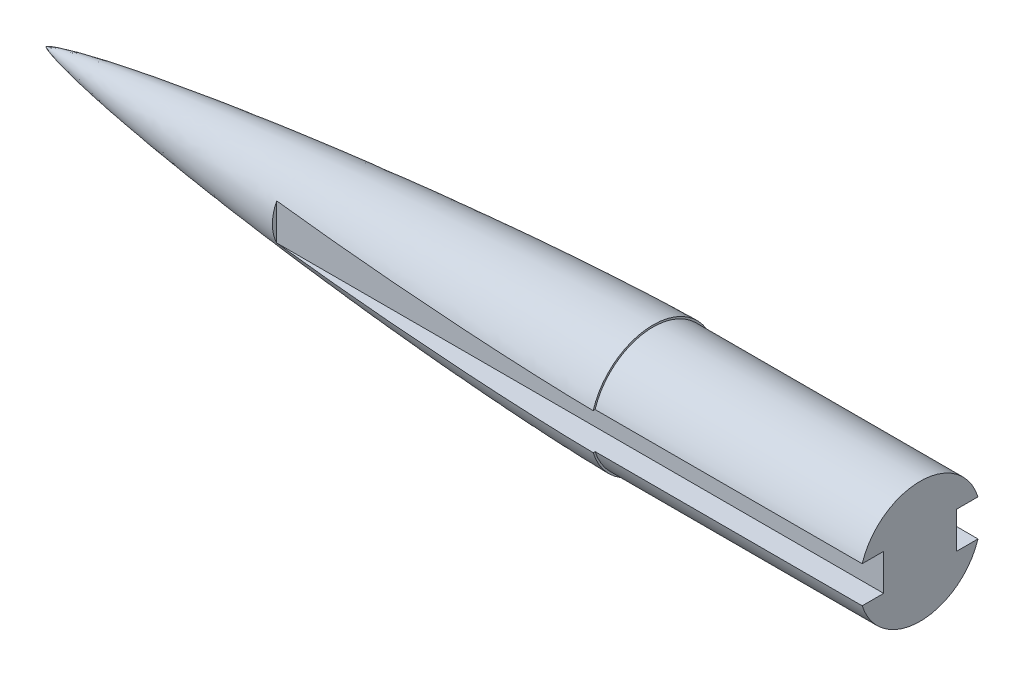
ISO-10303-21;
HEADER;
FILE_DESCRIPTION(('STEP AP214'),'2;1');
FILE_NAME('part.step','',(''),(''),'','','');
FILE_SCHEMA(('AUTOMOTIVE_DESIGN { 1 0 10303 214 1 1 1 1 }'));
ENDSEC;
DATA;
#1=APPLICATION_CONTEXT('core data for automotive mechanical design processes');
#2=APPLICATION_PROTOCOL_DEFINITION('international standard','automotive_design',2000,#1);
#3=PRODUCT_CONTEXT('',#1,'mechanical');
#4=PRODUCT('Part','Part','',(#3));
#5=PRODUCT_RELATED_PRODUCT_CATEGORY('part','',(#4));
#6=PRODUCT_DEFINITION_FORMATION('','',#4);
#7=PRODUCT_DEFINITION_CONTEXT('part definition',#1,'design');
#8=PRODUCT_DEFINITION('design','',#6,#7);
#9=PRODUCT_DEFINITION_SHAPE('','',#8);
#10=(LENGTH_UNIT() NAMED_UNIT(*) SI_UNIT(.MILLI.,.METRE.));
#11=(NAMED_UNIT(*) PLANE_ANGLE_UNIT() SI_UNIT($,.RADIAN.));
#12=(NAMED_UNIT(*) SI_UNIT($,.STERADIAN.) SOLID_ANGLE_UNIT());
#13=UNCERTAINTY_MEASURE_WITH_UNIT(LENGTH_MEASURE(1.E-05),#10,'distance_accuracy_value','');
#14=(GEOMETRIC_REPRESENTATION_CONTEXT(3) GLOBAL_UNCERTAINTY_ASSIGNED_CONTEXT((#13)) GLOBAL_UNIT_ASSIGNED_CONTEXT((#10,
#11,#12)) REPRESENTATION_CONTEXT('',''));
#15=CARTESIAN_POINT('',(0.,0.,0.));
#16=DIRECTION('',(0.,0.,1.));
#17=DIRECTION('',(1.,0.,0.));
#18=AXIS2_PLACEMENT_3D('',#15,#16,#17);
#19=CARTESIAN_POINT('',(635.,65.405,0.));
#20=CARTESIAN_POINT('',(632.980968041376,65.3999049079982,0.));
#21=CARTESIAN_POINT('',(628.943051518666,65.3607987649682,0.));
#22=CARTESIAN_POINT('',(620.867800743739,65.238425835158,0.));
#23=CARTESIAN_POINT('',(607.876612197197,64.9420444267635,0.));
#24=CARTESIAN_POINT('',(591.989866173885,64.4665825864284,0.));
#25=CARTESIAN_POINT('',(568.294487812533,63.5924578117391,0.));
#26=CARTESIAN_POINT('',(538.814064527861,62.2664605978091,0.));
#27=CARTESIAN_POINT('',(504.434100625351,60.4361863708921,0.));
#28=CARTESIAN_POINT('',(465.161890456531,58.0127528854532,0.));
#29=CARTESIAN_POINT('',(425.909385737502,55.2895252497301,0.));
#30=CARTESIAN_POINT('',(386.677550901074,52.2836135264071,0.));
#31=CARTESIAN_POINT('',(347.46776242828,49.0025673324941,0.));
#32=CARTESIAN_POINT('',(308.282068325667,45.4454012222465,0.));
#33=CARTESIAN_POINT('',(269.123174714222,41.6037605555624,0.));
#34=CARTESIAN_POINT('',(229.995170684784,37.4592339547084,0.));
#35=CARTESIAN_POINT('',(190.90356887878,32.9826992551564,0.));
#36=CARTESIAN_POINT('',(151.857530337521,28.1241973222402,0.));
#37=CARTESIAN_POINT('',(112.870807325211,22.8061369351955,0.));
#38=CARTESIAN_POINT('',(77.9573287846358,17.4873019784259,0.));
#39=CARTESIAN_POINT('',(49.1787935546804,12.5135793040533,0.));
#40=CARTESIAN_POINT('',(28.2617417770008,8.30499279351691,0.));
#41=CARTESIAN_POINT('',(16.0220282949449,5.44625020056791,0.));
#42=CARTESIAN_POINT('',(8.93318062814798,3.51548578780447,0.));
#43=CARTESIAN_POINT('',(5.16339541485639,2.32840347516785,0.));
#44=CARTESIAN_POINT('',(3.11582679923173,1.59218900684347,0.));
#45=CARTESIAN_POINT('',(1.97027691704133,1.1275016191836,0.));
#46=CARTESIAN_POINT('',(1.33181141167439,0.839140676757945,0.));
#47=CARTESIAN_POINT('',(0.95671602904962,0.653660621097922,0.));
#48=CARTESIAN_POINT('',(0.715531562152649,0.525146597932932,0.));
#49=CARTESIAN_POINT('',(0.550210431495335,0.431764809009291,0.));
#50=CARTESIAN_POINT('',(0.406270251751136,0.344359984283262,0.));
#51=CARTESIAN_POINT('',(0.283649615611126,0.263361482709997,0.));
#52=CARTESIAN_POINT('',(0.181602895816827,0.18888943286587,0.));
#53=CARTESIAN_POINT('',(0.109817079168359,0.130424863371353,0.));
#54=CARTESIAN_POINT('',(0.0569836765196351,0.0804262546774983,0.));
#55=CARTESIAN_POINT('',(0.0222716682134025,0.0403845586316774,0.));
#56=CARTESIAN_POINT('',(0.00752296936524731,0.0183675987536798,0.));
#57=CARTESIAN_POINT('',(0.00219211488346488,0.0062902080222314,0.));
#58=CARTESIAN_POINT('',(0.,0.,0.));
#59=B_SPLINE_CURVE_WITH_KNOTS('',4,(#19,#20,#21,#22,#23,#24,#25,#26,#27,#28,#29,#30,#31,#32,#33,
#34,#35,#36,#37,#38,#39,#40,#41,#42,#43,#44,#45,#46,#47,#48,#49,#50,#51,#52,#53,#54,#55,#56,#57,
#58),.UNSPECIFIED.,.F.,.F.,(5,1,1,1,1,1,1,1,1,1,1,1,1,1,1,1,1,1,1,1,1,1,1,1,1,1,1,1,1,1,1,1,1,1,
1,1,5),(0.,0.0126278600836156,0.0252557201672313,0.0505114403344626,0.0812725997628029,
0.112033759191143,0.173556078208551,0.235078396298971,0.296600715210933,0.358123034494872,
0.419645352372099,0.481167670690979,0.542689989321029,0.604212308113024,0.665734626856386,
0.727256945203041,0.788779262537685,0.850301578000527,0.911823895791277,0.948128969524394,
0.971421118017023,0.983729988096585,0.990421707276453,0.994070390445943,0.996134035175531,
0.997335608030765,0.998151497389768,0.998451073952135,0.998750650514502,0.999044750264593,
0.999338850014684,0.999504137511013,0.999669425007342,0.999834712503671,0.999917356251836,
0.999958678125918,1.),.UNSPECIFIED.);
#60=CARTESIAN_POINT('',(0.,0.,0.));
#61=DIRECTION('',(-1.,0.,0.));
#62=AXIS1_PLACEMENT('',#60,#61);
#63=SURFACE_OF_REVOLUTION('',#59,#62);
#64=CARTESIAN_POINT('',(0.,0.,0.));
#65=VERTEX_POINT('',#64);
#66=VERTEX_LOOP('',#65);
#67=FACE_BOUND('',#66,.T.);
#68=CARTESIAN_POINT('',(635.,0.,0.));
#69=DIRECTION('',(-1.,0.,0.));
#70=DIRECTION('',(0.,0.,1.));
#71=AXIS2_PLACEMENT_3D('',#68,#69,#70);
#72=CIRCLE('',#71,65.405);
#73=CARTESIAN_POINT('',(635.,-19.05,-62.5692538312548));
#74=VERTEX_POINT('',#73);
#75=CARTESIAN_POINT('',(635.,-19.05,62.5692538312548));
#76=VERTEX_POINT('',#75);
#77=EDGE_CURVE('E339',#74,#76,#72,.T.);
#78=ORIENTED_EDGE('',*,*,#77,.T.);
#79=CARTESIAN_POINT('',(635.,-19.05,62.5692538312548));
#80=CARTESIAN_POINT('',(634.557083227714,-19.05,62.5680767827386));
#81=CARTESIAN_POINT('',(634.114169517042,-19.05,62.5660986690757));
#82=CARTESIAN_POINT('',(633.228351345894,-19.05,62.5608098709747));
#83=CARTESIAN_POINT('',(632.785446885394,-19.05,62.5574991908365));
#84=CARTESIAN_POINT('',(631.89965061563,-19.05,62.5498148354016));
#85=CARTESIAN_POINT('',(631.4567588063,-19.05,62.5454411676234));
#86=CARTESIAN_POINT('',(630.570984215481,-19.05,62.535832944144));
#87=CARTESIAN_POINT('',(630.128101434002,-19.05,62.5305983876272));
#88=CARTESIAN_POINT('',(628.799478545877,-19.05,62.5138639372397));
#89=CARTESIAN_POINT('',(627.913751433359,-19.05,62.5013331442501));
#90=CARTESIAN_POINT('',(626.142327837132,-19.05,62.4741748127137));
#91=CARTESIAN_POINT('',(625.256631353498,-19.05,62.4595472693344));
#92=CARTESIAN_POINT('',(623.485390490442,-19.05,62.428380840316));
#93=CARTESIAN_POINT('',(622.599846106515,-19.05,62.411842210447));
#94=CARTESIAN_POINT('',(620.828792008821,-19.05,62.3770503313055));
#95=CARTESIAN_POINT('',(619.943282295023,-19.05,62.3587970836627));
#96=CARTESIAN_POINT('',(618.172292993631,-19.05,62.3207165380793));
#97=CARTESIAN_POINT('',(617.286813406182,-19.05,62.3008892334446));
#98=CARTESIAN_POINT('',(615.515887967395,-19.05,62.2597749944506));
#99=CARTESIAN_POINT('',(614.630442116068,-19.05,62.2384880596449));
#100=CARTESIAN_POINT('',(611.974244993545,-19.05,62.1725975135477));
#101=CARTESIAN_POINT('',(610.203543874418,-19.05,62.1259621974595));
#102=CARTESIAN_POINT('',(606.662276890252,-19.05,62.0279383805772));
#103=CARTESIAN_POINT('',(604.891711025004,-19.05,61.97654988728));
#104=CARTESIAN_POINT('',(601.350746669525,-19.05,61.869453214738));
#105=CARTESIAN_POINT('',(599.580348176592,-19.05,61.8137451247721));
#106=CARTESIAN_POINT('',(596.039682239263,-19.05,61.6982997093811));
#107=CARTESIAN_POINT('',(594.269414794927,-19.05,61.6385623821518));
#108=CARTESIAN_POINT('',(588.95883696801,-19.05,61.4537211090585));
#109=CARTESIAN_POINT('',(585.418721528203,-19.05,61.3229869683053));
#110=CARTESIAN_POINT('',(578.339012892391,-19.05,61.0481671003937));
#111=CARTESIAN_POINT('',(574.799419696279,-19.05,60.9040813759957));
#112=CARTESIAN_POINT('',(567.722059853378,-19.05,60.6038120220145));
#113=CARTESIAN_POINT('',(564.184293015472,-19.05,60.4476328904689));
#114=CARTESIAN_POINT('',(557.109224970274,-19.05,60.1239884992728));
#115=CARTESIAN_POINT('',(553.571923770502,-19.05,59.956523075538));
#116=CARTESIAN_POINT('',(546.497790316003,-19.05,59.6109883948176));
#117=CARTESIAN_POINT('',(542.960958068526,-19.05,59.4329189895628));
#118=CARTESIAN_POINT('',(535.887771335781,-19.05,59.0667592304303));
#119=CARTESIAN_POINT('',(532.351416856595,-19.05,58.8786687591731));
#120=CARTESIAN_POINT('',(525.279200186501,-19.05,58.4929330268145));
#121=CARTESIAN_POINT('',(521.743337999863,-19.05,58.2952876874633));
#122=CARTESIAN_POINT('',(514.672127138324,-19.05,57.8908005712422));
#123=CARTESIAN_POINT('',(511.13677846542,-19.05,57.6839587595328));
#124=CARTESIAN_POINT('',(501.257875484606,-19.05,57.0935266125025));
#125=CARTESIAN_POINT('',(494.914908059981,-19.05,56.7000791009063));
#126=CARTESIAN_POINT('',(482.230757328668,-19.05,55.8859928959795));
#127=CARTESIAN_POINT('',(475.889574012391,-19.05,55.4653543516972));
#128=CARTESIAN_POINT('',(463.209023514057,-19.05,54.5978206233442));
#129=CARTESIAN_POINT('',(456.869656326529,-19.05,54.1509255192251));
#130=CARTESIAN_POINT('',(444.192797036056,-19.05,53.2315009162489));
#131=CARTESIAN_POINT('',(437.855304928706,-19.05,52.7589714780941));
#132=CARTESIAN_POINT('',(425.182276303033,-19.05,51.7885903788954));
#133=CARTESIAN_POINT('',(418.8467397797,-19.05,51.29073878326));
#134=CARTESIAN_POINT('',(406.177720562544,-19.05,50.2697854229068));
#135=CARTESIAN_POINT('',(399.844237862635,-19.05,49.7466837337029));
#136=CARTESIAN_POINT('',(387.175311204038,-19.05,48.6746948739136));
#137=CARTESIAN_POINT('',(380.839868643589,-19.05,48.1257911751438));
#138=CARTESIAN_POINT('',(368.171282857661,-19.05,47.0020631167245));
#139=CARTESIAN_POINT('',(361.838139631864,-19.05,46.4272387606654));
#140=CARTESIAN_POINT('',(349.174326985137,-19.05,45.2509275709008));
#141=CARTESIAN_POINT('',(342.843657564713,-19.05,44.6494407317415));
#142=CARTESIAN_POINT('',(330.184998888784,-19.05,43.4187476888266));
#143=CARTESIAN_POINT('',(323.857009639081,-19.05,42.789541425367));
#144=CARTESIAN_POINT('',(311.203948862567,-19.05,41.5019762697636));
#145=CARTESIAN_POINT('',(304.87887735573,-19.05,40.8436171809514));
#146=CARTESIAN_POINT('',(295.393711650985,-19.05,39.8327429327034));
#147=CARTESIAN_POINT('',(292.232371358853,-19.05,39.4918927566739));
#148=CARTESIAN_POINT('',(285.910572365251,-19.05,38.8020972218567));
#149=CARTESIAN_POINT('',(282.750113664291,-19.05,38.4531518584028));
#150=CARTESIAN_POINT('',(279.590122994068,-19.05,38.1000000000001));
#151=B_SPLINE_CURVE_WITH_KNOTS('',3,(#79,#80,#81,#82,#83,#84,#85,#86,#87,#88,#89,#90,#91,#92,
#93,#94,#95,#96,#97,#98,#99,#100,#101,#102,#103,#104,#105,#106,#107,#108,#109,#110,#111,#112,
#113,#114,#115,#116,#117,#118,#119,#120,#121,#122,#123,#124,#125,#126,#127,#128,#129,#130,#131,
#132,#133,#134,#135,#136,#137,#138,#139,#140,#141,#142,#143,#144,#145,#146,#147,#148,#149,#150),
.UNSPECIFIED.,.F.,.F.,(4,2,2,2,2,2,2,2,2,2,2,2,2,2,2,2,2,2,2,2,2,2,2,2,2,2,2,2,2,2,2,2,2,2,2,4),
(0.,1.32875293976185,2.65750159196408,3.98624084643328,5.31498135989972,7.9724249987702,
10.6298747626342,13.2869692779771,15.9440612676412,18.6011645575266,21.2582686597338,
26.5722059631715,31.886134885276,37.1999540063862,42.5137755066771,53.1413297766517,
63.7688818494151,74.3924999102607,85.0162724545974,95.640193579748,106.264239173051,
116.888371786844,127.512544651846,146.577952725099,165.643256299794,184.708501823413,
203.773702202304,222.83885333723,241.90394745863,260.981425258237,280.0589004153,
299.136379474817,318.213899626885,337.291548497805,346.830525772525,356.369508545715),.UNSPECIFIED.);
#152=CARTESIAN_POINT('',(279.590122994068,-19.05,38.1));
#153=VERTEX_POINT('',#152);
#154=EDGE_CURVE('E268',#76,#153,#151,.T.);
#155=ORIENTED_EDGE('',*,*,#154,.T.);
#156=CARTESIAN_POINT('',(279.4,-19.0074579829743,38.1));
#157=CARTESIAN_POINT('',(279.463374331356,-19.0216386553162,38.1));
#158=CARTESIAN_POINT('',(279.526748662712,-19.0358193276581,38.1));
#159=CARTESIAN_POINT('',(279.590122994068,-19.05,38.1));
#160=B_SPLINE_CURVE_WITH_KNOTS('',3,(#156,#157,#158,#159),.UNSPECIFIED.,.F.,.F.,(4,4),(0.,
0.19482447506949),.UNSPECIFIED.);
#161=CARTESIAN_POINT('',(279.4,-19.0074579829743,38.1));
#162=VERTEX_POINT('',#161);
#163=EDGE_CURVE('E253',#162,#153,#160,.T.);
#164=ORIENTED_EDGE('',*,*,#163,.F.);
#165=CARTESIAN_POINT('',(279.4,0.,0.));
#166=DIRECTION('',(-1.,0.,0.));
#167=DIRECTION('',(0.,0.,1.));
#168=AXIS2_PLACEMENT_3D('',#165,#166,#167);
#169=CIRCLE('',#168,42.5780866053718);
#170=CARTESIAN_POINT('',(279.4,19.0074579829743,38.1));
#171=VERTEX_POINT('',#170);
#172=EDGE_CURVE('E11',#171,#162,#169,.F.);
#173=ORIENTED_EDGE('',*,*,#172,.F.);
#174=CARTESIAN_POINT('',(279.590122994068,19.05,38.1));
#175=CARTESIAN_POINT('',(279.526748662712,19.0358193276581,38.1));
#176=CARTESIAN_POINT('',(279.463374331356,19.0216386553162,38.1));
#177=CARTESIAN_POINT('',(279.4,19.0074579829743,38.1));
#178=B_SPLINE_CURVE_WITH_KNOTS('',3,(#174,#175,#176,#177),.UNSPECIFIED.,.F.,.F.,(4,4),(0.,
0.194824475069432),.UNSPECIFIED.);
#179=CARTESIAN_POINT('',(279.590122994068,19.05,38.1));
#180=VERTEX_POINT('',#179);
#181=EDGE_CURVE('E245',#180,#171,#178,.T.);
#182=ORIENTED_EDGE('',*,*,#181,.F.);
#183=CARTESIAN_POINT('',(635.,19.05,62.5692538312549));
#184=CARTESIAN_POINT('',(634.557083227714,19.05,62.5680767827386));
#185=CARTESIAN_POINT('',(634.114169517042,19.05,62.5660986690757));
#186=CARTESIAN_POINT('',(633.228351345894,19.05,62.5608098709747));
#187=CARTESIAN_POINT('',(632.785446885394,19.05,62.5574991908365));
#188=CARTESIAN_POINT('',(631.89965061563,19.05,62.5498148354016));
#189=CARTESIAN_POINT('',(631.4567588063,19.05,62.5454411676234));
#190=CARTESIAN_POINT('',(630.570984215481,19.05,62.535832944144));
#191=CARTESIAN_POINT('',(630.128101434002,19.05,62.5305983876272));
#192=CARTESIAN_POINT('',(628.799478545877,19.05,62.5138639372397));
#193=CARTESIAN_POINT('',(627.913751433359,19.05,62.5013331442501));
#194=CARTESIAN_POINT('',(626.142327837132,19.05,62.4741748127137));
#195=CARTESIAN_POINT('',(625.256631353498,19.05,62.4595472693344));
#196=CARTESIAN_POINT('',(623.485390490442,19.05,62.428380840316));
#197=CARTESIAN_POINT('',(622.599846106515,19.05,62.411842210447));
#198=CARTESIAN_POINT('',(620.828792008821,19.05,62.3770503313055));
#199=CARTESIAN_POINT('',(619.943282295023,19.05,62.3587970836627));
#200=CARTESIAN_POINT('',(618.172292993631,19.05,62.3207165380793));
#201=CARTESIAN_POINT('',(617.286813406182,19.05,62.3008892334447));
#202=CARTESIAN_POINT('',(615.515887967395,19.05,62.2597749944506));
#203=CARTESIAN_POINT('',(614.630442116068,19.05,62.238488059645));
#204=CARTESIAN_POINT('',(611.974244993545,19.05,62.1725975135477));
#205=CARTESIAN_POINT('',(610.203543874418,19.05,62.1259621974595));
#206=CARTESIAN_POINT('',(606.662276890252,19.05,62.0279383805772));
#207=CARTESIAN_POINT('',(604.891711025004,19.05,61.97654988728));
#208=CARTESIAN_POINT('',(601.350746669525,19.05,61.869453214738));
#209=CARTESIAN_POINT('',(599.580348176592,19.05,61.8137451247722));
#210=CARTESIAN_POINT('',(596.039682239263,19.05,61.6982997093811));
#211=CARTESIAN_POINT('',(594.269414794926,19.05,61.6385623821518));
#212=CARTESIAN_POINT('',(588.95883696801,19.05,61.4537211090585));
#213=CARTESIAN_POINT('',(585.418721528203,19.05,61.3229869683053));
#214=CARTESIAN_POINT('',(578.339012892391,19.05,61.0481671003937));
#215=CARTESIAN_POINT('',(574.799419696279,19.05,60.9040813759957));
#216=CARTESIAN_POINT('',(567.722059853378,19.05,60.6038120220145));
#217=CARTESIAN_POINT('',(564.184293015471,19.05,60.4476328904689));
#218=CARTESIAN_POINT('',(557.109224970274,19.05,60.1239884992728));
#219=CARTESIAN_POINT('',(553.571923770502,19.05,59.956523075538));
#220=CARTESIAN_POINT('',(546.497790316003,19.05,59.6109883948176));
#221=CARTESIAN_POINT('',(542.960958068526,19.05,59.4329189895628));
#222=CARTESIAN_POINT('',(535.887771335781,19.05,59.0667592304303));
#223=CARTESIAN_POINT('',(532.351416856594,19.05,58.8786687591731));
#224=CARTESIAN_POINT('',(525.279200186501,19.05,58.4929330268145));
#225=CARTESIAN_POINT('',(521.743337999863,19.05,58.2952876874633));
#226=CARTESIAN_POINT('',(514.672127138324,19.05,57.8908005712422));
#227=CARTESIAN_POINT('',(511.136778465419,19.05,57.6839587595328));
#228=CARTESIAN_POINT('',(501.257875484605,19.05,57.0935266125026));
#229=CARTESIAN_POINT('',(494.914908059981,19.05,56.7000791009063));
#230=CARTESIAN_POINT('',(482.230757328667,19.05,55.8859928959795));
#231=CARTESIAN_POINT('',(475.88957401239,19.05,55.4653543516972));
#232=CARTESIAN_POINT('',(463.209023514057,19.05,54.5978206233442));
#233=CARTESIAN_POINT('',(456.869656326529,19.05,54.1509255192251));
#234=CARTESIAN_POINT('',(444.192797036056,19.05,53.2315009162489));
#235=CARTESIAN_POINT('',(437.855304928706,19.05,52.7589714780941));
#236=CARTESIAN_POINT('',(425.182276303033,19.05,51.7885903788954));
#237=CARTESIAN_POINT('',(418.8467397797,19.05,51.29073878326));
#238=CARTESIAN_POINT('',(406.177720562544,19.05,50.2697854229068));
#239=CARTESIAN_POINT('',(399.844237862635,19.05,49.7466837337029));
#240=CARTESIAN_POINT('',(387.175311204038,19.05,48.6746948739136));
#241=CARTESIAN_POINT('',(380.839868643589,19.05,48.1257911751439));
#242=CARTESIAN_POINT('',(368.171282857661,19.05,47.0020631167245));
#243=CARTESIAN_POINT('',(361.838139631864,19.05,46.4272387606654));
#244=CARTESIAN_POINT('',(349.174326985137,19.05,45.2509275709008));
#245=CARTESIAN_POINT('',(342.843657564713,19.05,44.6494407317415));
#246=CARTESIAN_POINT('',(330.184998888784,19.05,43.4187476888266));
#247=CARTESIAN_POINT('',(323.857009639081,19.05,42.789541425367));
#248=CARTESIAN_POINT('',(311.203948862567,19.05,41.5019762697636));
#249=CARTESIAN_POINT('',(304.87887735573,19.05,40.8436171809513));
#250=CARTESIAN_POINT('',(295.393711650985,19.05,39.8327429327034));
#251=CARTESIAN_POINT('',(292.232371358853,19.05,39.4918927566739));
#252=CARTESIAN_POINT('',(285.910572365251,19.05,38.8020972218567));
#253=CARTESIAN_POINT('',(282.750113664291,19.05,38.4531518584028));
#254=CARTESIAN_POINT('',(279.590122994068,19.05,38.1));
#255=B_SPLINE_CURVE_WITH_KNOTS('',3,(#183,#184,#185,#186,#187,#188,#189,#190,#191,#192,#193,
#194,#195,#196,#197,#198,#199,#200,#201,#202,#203,#204,#205,#206,#207,#208,#209,#210,#211,#212,
#213,#214,#215,#216,#217,#218,#219,#220,#221,#222,#223,#224,#225,#226,#227,#228,#229,#230,#231,
#232,#233,#234,#235,#236,#237,#238,#239,#240,#241,#242,#243,#244,#245,#246,#247,#248,#249,#250,
#251,#252,#253,#254),.UNSPECIFIED.,.F.,.F.,(4,2,2,2,2,2,2,2,2,2,2,2,2,2,2,2,2,2,2,2,2,2,2,2,2,2,
2,2,2,2,2,2,2,2,2,4),(0.,1.32875293976185,2.65750159196408,3.98624084643328,5.31498135989972,
7.9724249987702,10.6298747626342,13.2869692779773,15.9440612676413,18.6011645575266,
21.2582686597339,26.5722059631715,31.886134885276,37.1999540063863,42.5137755066772,
53.1413297766518,63.7688818494152,74.3924999102609,85.0162724545975,95.640193579748,
106.264239173051,116.888371786844,127.512544651846,146.577952725099,165.643256299795,
184.708501823413,203.773702202304,222.83885333723,241.90394745863,260.981425258237,
280.0589004153,299.136379474817,318.213899626885,337.291548497805,346.830525772525,
356.369508545715),.UNSPECIFIED.);
#256=CARTESIAN_POINT('',(635.,19.05,62.5692538312549));
#257=VERTEX_POINT('',#256);
#258=EDGE_CURVE('E140',#257,#180,#255,.T.);
#259=ORIENTED_EDGE('',*,*,#258,.F.);
#260=CARTESIAN_POINT('',(635.,19.05,-62.5692538312549));
#261=VERTEX_POINT('',#260);
#262=EDGE_CURVE('E316',#257,#261,#72,.T.);
#263=ORIENTED_EDGE('',*,*,#262,.T.);
#264=CARTESIAN_POINT('',(279.590122994068,19.05,-38.1));
#265=CARTESIAN_POINT('',(282.154304254426,19.05,-38.386567500689));
#266=CARTESIAN_POINT('',(284.718794843188,19.05,-38.6703634822735));
#267=CARTESIAN_POINT('',(289.848373753049,19.05,-39.2325861494204));
#268=CARTESIAN_POINT('',(292.413462076229,19.05,-39.5110128160013));
#269=CARTESIAN_POINT('',(297.54420571792,19.05,-40.0626694659527));
#270=CARTESIAN_POINT('',(300.109861038242,19.05,-40.3358994324777));
#271=CARTESIAN_POINT('',(305.241710811943,19.05,-40.8773112924891));
#272=CARTESIAN_POINT('',(307.807905266686,19.05,-41.1454931730547));
#273=CARTESIAN_POINT('',(312.940806977443,19.05,-41.6769422665088));
#274=CARTESIAN_POINT('',(315.507514234249,19.05,-41.9402094717561));
#275=CARTESIAN_POINT('',(320.64251664407,19.05,-42.46205881407));
#276=CARTESIAN_POINT('',(323.210812006091,19.05,-42.7206388942141));
#277=CARTESIAN_POINT('',(328.347868700835,19.05,-43.2331023005303));
#278=CARTESIAN_POINT('',(330.916630033105,19.05,-43.4869856312603));
#279=CARTESIAN_POINT('',(336.054596984413,19.05,-43.9901470426831));
#280=CARTESIAN_POINT('',(338.623802602302,19.05,-44.2394251351226));
#281=CARTESIAN_POINT('',(343.76263762365,19.05,-44.7334576117093));
#282=CARTESIAN_POINT('',(346.332267025231,19.05,-44.9782120153911));
#283=CARTESIAN_POINT('',(351.471929397053,19.05,-45.4632672733546));
#284=CARTESIAN_POINT('',(354.041962364674,19.05,-45.7035681554344));
#285=CARTESIAN_POINT('',(364.008530601062,19.05,-46.626879012899));
#286=CARTESIAN_POINT('',(371.406551205955,19.05,-47.2939283581578));
#287=CARTESIAN_POINT('',(386.205654518171,19.05,-48.5928456238293));
#288=CARTESIAN_POINT('',(393.606737217365,19.05,-49.2247136370437));
#289=CARTESIAN_POINT('',(408.411881354449,19.05,-50.4538591307998));
#290=CARTESIAN_POINT('',(415.815942833299,19.05,-51.0511361181022));
#291=CARTESIAN_POINT('',(430.626991353437,19.05,-52.2112048668466));
#292=CARTESIAN_POINT('',(438.033978476205,19.05,-52.7739955879485));
#293=CARTESIAN_POINT('',(452.850863033962,19.05,-53.864738183727));
#294=CARTESIAN_POINT('',(460.26076058778,19.05,-54.3926884447984));
#295=CARTESIAN_POINT('',(475.083492966296,19.05,-55.4128635013946));
#296=CARTESIAN_POINT('',(482.496327948537,19.05,-55.9050860099876));
#297=CARTESIAN_POINT('',(497.321234006364,19.05,-56.8520659955892));
#298=CARTESIAN_POINT('',(504.733304071458,19.05,-57.306839280942));
#299=CARTESIAN_POINT('',(519.559830923327,19.05,-58.1768495837005));
#300=CARTESIAN_POINT('',(526.974287727745,19.05,-58.5920863017723));
#301=CARTESIAN_POINT('',(538.09755577566,19.05,-59.1827228904915));
#302=CARTESIAN_POINT('',(541.805516505145,19.05,-59.3742292106291));
#303=CARTESIAN_POINT('',(549.222006864052,19.05,-59.7458731585732));
#304=CARTESIAN_POINT('',(552.93053649309,19.05,-59.9260107940144));
#305=CARTESIAN_POINT('',(560.347925471015,19.05,-60.2741669949865));
#306=CARTESIAN_POINT('',(564.056784783222,19.05,-60.442186341202));
#307=CARTESIAN_POINT('',(571.47506756064,19.05,-60.765228651704));
#308=CARTESIAN_POINT('',(575.184491025355,19.05,-60.9202516273525));
#309=CARTESIAN_POINT('',(582.603613630056,19.05,-61.2160311848763));
#310=CARTESIAN_POINT('',(586.313312724925,19.05,-61.3567888959625));
#311=CARTESIAN_POINT('',(593.733300790644,19.05,-61.6223152312504));
#312=CARTESIAN_POINT('',(597.443589763444,19.05,-61.7470838014711));
#313=CARTESIAN_POINT('',(603.009391752201,19.05,-61.9203948900794));
#314=CARTESIAN_POINT('',(604.864690583839,19.05,-61.9758575090889));
#315=CARTESIAN_POINT('',(608.575434114959,19.05,-62.0817454722749));
#316=CARTESIAN_POINT('',(610.430878814537,19.05,-62.1321708130659));
#317=CARTESIAN_POINT('',(614.141902709082,19.05,-62.2272950830336));
#318=CARTESIAN_POINT('',(615.997481903039,19.05,-62.2719940514622));
#319=CARTESIAN_POINT('',(619.708787079938,19.05,-62.3547526195567));
#320=CARTESIAN_POINT('',(621.564513062584,19.05,-62.392812232289));
#321=CARTESIAN_POINT('',(624.063567128687,19.05,-62.4386766112117));
#322=CARTESIAN_POINT('',(624.706831328346,19.05,-62.4500014188895));
#323=CARTESIAN_POINT('',(625.993377724422,19.05,-62.4716005941858));
#324=CARTESIAN_POINT('',(626.636659920848,19.05,-62.481874961368));
#325=CARTESIAN_POINT('',(627.923240251853,19.05,-62.5012937105878));
#326=CARTESIAN_POINT('',(628.566538386401,19.05,-62.5104380947525));
#327=CARTESIAN_POINT('',(629.853164392036,19.05,-62.5273566869226));
#328=CARTESIAN_POINT('',(630.496492263449,19.05,-62.5351308702338));
#329=CARTESIAN_POINT('',(631.783169429674,19.05,-62.5488520904664));
#330=CARTESIAN_POINT('',(632.426518724516,19.05,-62.5547991246946));
#331=CARTESIAN_POINT('',(633.713242727758,19.05,-62.5641314786));
#332=CARTESIAN_POINT('',(634.356617436364,19.05,-62.5675167691255));
#333=CARTESIAN_POINT('',(635.,19.05,-62.5692538312549));
#334=B_SPLINE_CURVE_WITH_KNOTS('',3,(#264,#265,#266,#267,#268,#269,#270,#271,#272,#273,#274,
#275,#276,#277,#278,#279,#280,#281,#282,#283,#284,#285,#286,#287,#288,#289,#290,#291,#292,#293,
#294,#295,#296,#297,#298,#299,#300,#301,#302,#303,#304,#305,#306,#307,#308,#309,#310,#311,#312,
#313,#314,#315,#316,#317,#318,#319,#320,#321,#322,#323,#324,#325,#326,#327,#328,#329,#330,#331,
#332,#333),.UNSPECIFIED.,.F.,.F.,(4,2,2,2,2,2,2,2,2,2,2,2,2,2,2,2,2,2,2,2,2,2,2,2,2,2,2,2,2,2,2,
2,2,2,4),(0.,7.74043187483129,15.480891108617,23.2213754292033,30.9618795591036,
38.7023957229346,46.446230324169,54.1900574101581,61.9338647412358,69.6776386243881,
77.4213641559077,99.7053636527039,121.989304365698,144.273562751056,166.558493050461,
188.844454733384,211.131841683888,233.409771767489,255.687870505418,266.826564923462,
277.965251861283,289.103220580281,300.241179561844,311.378256194228,322.515370425501,
328.083747964603,333.652129246101,339.220472356586,344.788804508302,346.718895505224,
348.648987304095,350.579075469828,352.50919841659,354.439324208196,356.369471963611),.UNSPECIFIED.);
#335=CARTESIAN_POINT('',(279.590122994068,19.05,-38.1));
#336=VERTEX_POINT('',#335);
#337=EDGE_CURVE('E287',#336,#261,#334,.T.);
#338=ORIENTED_EDGE('',*,*,#337,.F.);
#339=CARTESIAN_POINT('',(279.590122994068,19.05,-38.1));
#340=CARTESIAN_POINT('',(279.526748662712,19.0358193276581,-38.1));
#341=CARTESIAN_POINT('',(279.463374331356,19.0216386553163,-38.1));
#342=CARTESIAN_POINT('',(279.4,19.0074579829744,-38.1));
#343=B_SPLINE_CURVE_WITH_KNOTS('',3,(#339,#340,#341,#342),.UNSPECIFIED.,.F.,.F.,(4,4),(0.,
0.194824475069095),.UNSPECIFIED.);
#344=CARTESIAN_POINT('',(279.4,19.0074579829744,-38.1));
#345=VERTEX_POINT('',#344);
#346=EDGE_CURVE('E230',#336,#345,#343,.T.);
#347=ORIENTED_EDGE('',*,*,#346,.T.);
#348=CARTESIAN_POINT('',(279.4,0.,0.));
#349=DIRECTION('',(-1.,0.,0.));
#350=DIRECTION('',(0.,0.,1.));
#351=AXIS2_PLACEMENT_3D('',#348,#349,#350);
#352=CIRCLE('',#351,42.5780866053718);
#353=CARTESIAN_POINT('',(279.4,-19.0074579829744,-38.1));
#354=VERTEX_POINT('',#353);
#355=EDGE_CURVE('E53',#354,#345,#352,.F.);
#356=ORIENTED_EDGE('',*,*,#355,.F.);
#357=CARTESIAN_POINT('',(279.4,-19.0074579829744,-38.1));
#358=CARTESIAN_POINT('',(279.463374331356,-19.0216386553163,-38.1));
#359=CARTESIAN_POINT('',(279.526748662712,-19.0358193276581,-38.1));
#360=CARTESIAN_POINT('',(279.590122994068,-19.05,-38.1));
#361=B_SPLINE_CURVE_WITH_KNOTS('',3,(#357,#358,#359,#360),.UNSPECIFIED.,.F.,.F.,(4,4),(0.,
0.194824475069261),.UNSPECIFIED.);
#362=CARTESIAN_POINT('',(279.590122994068,-19.05,-38.1));
#363=VERTEX_POINT('',#362);
#364=EDGE_CURVE('E237',#354,#363,#361,.T.);
#365=ORIENTED_EDGE('',*,*,#364,.T.);
#366=CARTESIAN_POINT('',(279.590122994068,-19.05,-38.1));
#367=CARTESIAN_POINT('',(282.154304254426,-19.05,-38.386567500689));
#368=CARTESIAN_POINT('',(284.718794843188,-19.05,-38.6703634822735));
#369=CARTESIAN_POINT('',(289.848373753049,-19.05,-39.2325861494205));
#370=CARTESIAN_POINT('',(292.413462076229,-19.05,-39.5110128160014));
#371=CARTESIAN_POINT('',(297.54420571792,-19.05,-40.0626694659527));
#372=CARTESIAN_POINT('',(300.109861038242,-19.05,-40.3358994324777));
#373=CARTESIAN_POINT('',(305.241710811944,-19.05,-40.8773112924891));
#374=CARTESIAN_POINT('',(307.807905266686,-19.05,-41.1454931730547));
#375=CARTESIAN_POINT('',(312.940806977443,-19.05,-41.6769422665089));
#376=CARTESIAN_POINT('',(315.50751423425,-19.05,-41.9402094717561));
#377=CARTESIAN_POINT('',(320.64251664407,-19.05,-42.46205881407));
#378=CARTESIAN_POINT('',(323.210812006091,-19.05,-42.7206388942141));
#379=CARTESIAN_POINT('',(328.347868700836,-19.05,-43.2331023005304));
#380=CARTESIAN_POINT('',(330.916630033105,-19.05,-43.4869856312603));
#381=CARTESIAN_POINT('',(336.054596984414,-19.05,-43.9901470426831));
#382=CARTESIAN_POINT('',(338.623802602303,-19.05,-44.2394251351226));
#383=CARTESIAN_POINT('',(343.762637623651,-19.05,-44.7334576117093));
#384=CARTESIAN_POINT('',(346.332267025231,-19.05,-44.9782120153911));
#385=CARTESIAN_POINT('',(351.471929397053,-19.05,-45.4632672733546));
#386=CARTESIAN_POINT('',(354.041962364675,-19.05,-45.7035681554344));
#387=CARTESIAN_POINT('',(364.008530601062,-19.05,-46.626879012899));
#388=CARTESIAN_POINT('',(371.406551205955,-19.05,-47.2939283581578));
#389=CARTESIAN_POINT('',(386.205654518171,-19.05,-48.5928456238293));
#390=CARTESIAN_POINT('',(393.606737217365,-19.05,-49.2247136370437));
#391=CARTESIAN_POINT('',(408.411881354449,-19.05,-50.4538591307998));
#392=CARTESIAN_POINT('',(415.815942833299,-19.05,-51.0511361181022));
#393=CARTESIAN_POINT('',(430.626991353437,-19.05,-52.2112048668466));
#394=CARTESIAN_POINT('',(438.033978476205,-19.05,-52.7739955879486));
#395=CARTESIAN_POINT('',(452.850863033962,-19.05,-53.864738183727));
#396=CARTESIAN_POINT('',(460.26076058778,-19.05,-54.3926884447984));
#397=CARTESIAN_POINT('',(475.083492966296,-19.05,-55.4128635013945));
#398=CARTESIAN_POINT('',(482.496327948537,-19.05,-55.9050860099876));
#399=CARTESIAN_POINT('',(497.321234006364,-19.05,-56.8520659955892));
#400=CARTESIAN_POINT('',(504.733304071458,-19.05,-57.3068392809419));
#401=CARTESIAN_POINT('',(519.559830923327,-19.05,-58.1768495837005));
#402=CARTESIAN_POINT('',(526.974287727745,-19.05,-58.5920863017723));
#403=CARTESIAN_POINT('',(538.09755577566,-19.05,-59.1827228904915));
#404=CARTESIAN_POINT('',(541.805516505145,-19.05,-59.3742292106291));
#405=CARTESIAN_POINT('',(549.222006864051,-19.05,-59.7458731585732));
#406=CARTESIAN_POINT('',(552.93053649309,-19.05,-59.9260107940143));
#407=CARTESIAN_POINT('',(560.347925471014,-19.05,-60.2741669949864));
#408=CARTESIAN_POINT('',(564.056784783222,-19.05,-60.442186341202));
#409=CARTESIAN_POINT('',(571.47506756064,-19.05,-60.765228651704));
#410=CARTESIAN_POINT('',(575.184491025354,-19.05,-60.9202516273525));
#411=CARTESIAN_POINT('',(582.603613630056,-19.05,-61.2160311848763));
#412=CARTESIAN_POINT('',(586.313312724925,-19.05,-61.3567888959625));
#413=CARTESIAN_POINT('',(593.733300790644,-19.05,-61.6223152312503));
#414=CARTESIAN_POINT('',(597.443589763444,-19.05,-61.7470838014711));
#415=CARTESIAN_POINT('',(603.009391752201,-19.05,-61.9203948900794));
#416=CARTESIAN_POINT('',(604.864690583839,-19.05,-61.9758575090889));
#417=CARTESIAN_POINT('',(608.575434114958,-19.05,-62.0817454722749));
#418=CARTESIAN_POINT('',(610.430878814537,-19.05,-62.1321708130659));
#419=CARTESIAN_POINT('',(614.141902709082,-19.05,-62.2272950830336));
#420=CARTESIAN_POINT('',(615.997481903039,-19.05,-62.2719940514622));
#421=CARTESIAN_POINT('',(619.708787079938,-19.05,-62.3547526195567));
#422=CARTESIAN_POINT('',(621.564513062583,-19.05,-62.392812232289));
#423=CARTESIAN_POINT('',(624.063567128686,-19.05,-62.4386766112117));
#424=CARTESIAN_POINT('',(624.706831328345,-19.05,-62.4500014188895));
#425=CARTESIAN_POINT('',(625.993377724422,-19.05,-62.4716005941858));
#426=CARTESIAN_POINT('',(626.636659920847,-19.05,-62.481874961368));
#427=CARTESIAN_POINT('',(627.923240251853,-19.05,-62.5012937105878));
#428=CARTESIAN_POINT('',(628.566538386401,-19.05,-62.5104380947525));
#429=CARTESIAN_POINT('',(629.853164392036,-19.05,-62.5273566869226));
#430=CARTESIAN_POINT('',(630.496492263449,-19.05,-62.5351308702339));
#431=CARTESIAN_POINT('',(631.783169429674,-19.05,-62.5488520904664));
#432=CARTESIAN_POINT('',(632.426518724516,-19.05,-62.5547991246946));
#433=CARTESIAN_POINT('',(633.713242727758,-19.05,-62.5641314786));
#434=CARTESIAN_POINT('',(634.356617436364,-19.05,-62.5675167691255));
#435=CARTESIAN_POINT('',(635.,-19.05,-62.5692538312549));
#436=B_SPLINE_CURVE_WITH_KNOTS('',3,(#366,#367,#368,#369,#370,#371,#372,#373,#374,#375,#376,
#377,#378,#379,#380,#381,#382,#383,#384,#385,#386,#387,#388,#389,#390,#391,#392,#393,#394,#395,
#396,#397,#398,#399,#400,#401,#402,#403,#404,#405,#406,#407,#408,#409,#410,#411,#412,#413,#414,
#415,#416,#417,#418,#419,#420,#421,#422,#423,#424,#425,#426,#427,#428,#429,#430,#431,#432,#433,
#434,#435),.UNSPECIFIED.,.F.,.F.,(4,2,2,2,2,2,2,2,2,2,2,2,2,2,2,2,2,2,2,2,2,2,2,2,2,2,2,2,2,2,2,
2,2,2,4),(0.,7.74043187483129,15.480891108617,23.2213754292034,30.9618795591037,
38.7023957229347,46.446230324169,54.1900574101582,61.9338647412359,69.677638624388,
77.4213641559077,99.7053636527038,121.989304365697,144.273562751056,166.558493050461,
188.844454733384,211.131841683888,233.409771767488,255.687870505417,266.826564923462,
277.965251861282,289.103220580281,300.241179561843,311.378256194227,322.515370425501,
328.083747964603,333.652129246101,339.220472356586,344.788804508302,346.718895505224,
348.648987304094,350.579075469828,352.50919841659,354.439324208196,356.369471963611),.UNSPECIFIED.);
#437=EDGE_CURVE('E201',#363,#74,#436,.T.);
#438=ORIENTED_EDGE('',*,*,#437,.T.);
#439=EDGE_LOOP('',(#78,#155,#164,#173,#182,#259,#263,#338,#347,#356,#365,#438));
#440=FACE_BOUND('',#439,.T.);
#441=ADVANCED_FACE('F43',(#67,#440),#63,.T.);
#442=CARTESIAN_POINT('',(0.,0.,0.));
#443=DIRECTION('',(-1.,0.,0.));
#444=DIRECTION('',(0.,0.,1.));
#445=AXIS2_PLACEMENT_3D('',#442,#443,#444);
#446=CYLINDRICAL_SURFACE('',#445,63.5);
#447=DIRECTION('',(-1.,0.,0.));
#448=VECTOR('',#447,1.);
#449=CARTESIAN_POINT('',(0.,19.05,60.5751392899761));
#450=LINE('',#449,#448);
#451=CARTESIAN_POINT('',(914.4,19.05,60.5751392899761));
#452=VERTEX_POINT('',#451);
#453=CARTESIAN_POINT('',(635.,19.05,60.5751392899761));
#454=VERTEX_POINT('',#453);
#455=EDGE_CURVE('E68',#452,#454,#450,.T.);
#456=ORIENTED_EDGE('',*,*,#455,.F.);
#457=CARTESIAN_POINT('',(914.4,0.,0.));
#458=DIRECTION('',(1.,0.,0.));
#459=DIRECTION('',(0.,0.,-1.));
#460=AXIS2_PLACEMENT_3D('',#457,#458,#459);
#461=CIRCLE('',#460,63.5);
#462=CARTESIAN_POINT('',(914.4,19.05,-60.5751392899761));
#463=VERTEX_POINT('',#462);
#464=EDGE_CURVE('E160',#463,#452,#461,.T.);
#465=ORIENTED_EDGE('',*,*,#464,.F.);
#466=DIRECTION('',(-1.,0.,0.));
#467=VECTOR('',#466,1.);
#468=CARTESIAN_POINT('',(0.,19.05,-60.5751392899761));
#469=LINE('',#468,#467);
#470=CARTESIAN_POINT('',(635.,19.05,-60.5751392899761));
#471=VERTEX_POINT('',#470);
#472=EDGE_CURVE('E210',#471,#463,#469,.F.);
#473=ORIENTED_EDGE('',*,*,#472,.F.);
#474=CARTESIAN_POINT('',(635.,0.,0.));
#475=DIRECTION('',(-1.,0.,0.));
#476=DIRECTION('',(0.,0.,1.));
#477=AXIS2_PLACEMENT_3D('',#474,#475,#476);
#478=CIRCLE('',#477,63.5);
#479=EDGE_CURVE('E306',#454,#471,#478,.T.);
#480=ORIENTED_EDGE('',*,*,#479,.F.);
#481=EDGE_LOOP('',(#456,#465,#473,#480));
#482=FACE_BOUND('',#481,.T.);
#483=ADVANCED_FACE('F305',(#482),#446,.T.);
#484=DIRECTION('',(-1.,0.,0.));
#485=VECTOR('',#484,1.);
#486=CARTESIAN_POINT('',(0.,-19.05,-60.5751392899761));
#487=LINE('',#486,#485);
#488=CARTESIAN_POINT('',(635.,-19.05,-60.575139289976));
#489=VERTEX_POINT('',#488);
#490=CARTESIAN_POINT('',(914.4,-19.05,-60.5751392899761));
#491=VERTEX_POINT('',#490);
#492=EDGE_CURVE('E60',#489,#491,#487,.F.);
#493=ORIENTED_EDGE('',*,*,#492,.T.);
#494=CARTESIAN_POINT('',(914.4,0.,0.));
#495=DIRECTION('',(1.,0.,0.));
#496=DIRECTION('',(0.,0.,-1.));
#497=AXIS2_PLACEMENT_3D('',#494,#495,#496);
#498=CIRCLE('',#497,63.5);
#499=CARTESIAN_POINT('',(914.4,-19.05,60.5751392899761));
#500=VERTEX_POINT('',#499);
#501=EDGE_CURVE('E166',#500,#491,#498,.T.);
#502=ORIENTED_EDGE('',*,*,#501,.F.);
#503=DIRECTION('',(-1.,0.,0.));
#504=VECTOR('',#503,1.);
#505=CARTESIAN_POINT('',(0.,-19.05,60.5751392899761));
#506=LINE('',#505,#504);
#507=CARTESIAN_POINT('',(635.,-19.05,60.575139289976));
#508=VERTEX_POINT('',#507);
#509=EDGE_CURVE('E276',#500,#508,#506,.T.);
#510=ORIENTED_EDGE('',*,*,#509,.T.);
#511=EDGE_CURVE('E310',#489,#508,#478,.T.);
#512=ORIENTED_EDGE('',*,*,#511,.F.);
#513=EDGE_LOOP('',(#493,#502,#510,#512));
#514=FACE_BOUND('',#513,.T.);
#515=ADVANCED_FACE('F345',(#514),#446,.T.);
#516=CARTESIAN_POINT('',(635.,63.5,0.));
#517=DIRECTION('',(-1.,0.,0.));
#518=DIRECTION('',(0.,0.,1.));
#519=AXIS2_PLACEMENT_3D('',#516,#517,#518);
#520=PLANE('',#519);
#521=DIRECTION('',(0.,0.,1.));
#522=VECTOR('',#521,1.);
#523=CARTESIAN_POINT('',(635.,19.05,0.));
#524=LINE('',#523,#522);
#525=EDGE_CURVE('E321',#454,#257,#524,.T.);
#526=ORIENTED_EDGE('',*,*,#525,.F.);
#527=ORIENTED_EDGE('',*,*,#479,.T.);
#528=DIRECTION('',(0.,0.,1.));
#529=VECTOR('',#528,1.);
#530=CARTESIAN_POINT('',(635.,19.05,0.));
#531=LINE('',#530,#529);
#532=EDGE_CURVE('E300',#261,#471,#531,.T.);
#533=ORIENTED_EDGE('',*,*,#532,.F.);
#534=ORIENTED_EDGE('',*,*,#262,.F.);
#535=EDGE_LOOP('',(#526,#527,#533,#534));
#536=FACE_BOUND('',#535,.T.);
#537=ADVANCED_FACE('F342',(#536),#520,.F.);
#538=ORIENTED_EDGE('',*,*,#511,.T.);
#539=DIRECTION('',(0.,0.,1.));
#540=VECTOR('',#539,1.);
#541=CARTESIAN_POINT('',(635.,-19.05,0.));
#542=LINE('',#541,#540);
#543=EDGE_CURVE('E324',#508,#76,#542,.T.);
#544=ORIENTED_EDGE('',*,*,#543,.T.);
#545=ORIENTED_EDGE('',*,*,#77,.F.);
#546=DIRECTION('',(0.,0.,1.));
#547=VECTOR('',#546,1.);
#548=CARTESIAN_POINT('',(635.,-19.05,0.));
#549=LINE('',#548,#547);
#550=EDGE_CURVE('E309',#74,#489,#549,.T.);
#551=ORIENTED_EDGE('',*,*,#550,.T.);
#552=EDGE_LOOP('',(#538,#544,#545,#551));
#553=FACE_BOUND('',#552,.T.);
#554=ADVANCED_FACE('F344',(#553),#520,.F.);
#555=CARTESIAN_POINT('',(279.4,0.,0.));
#556=DIRECTION('',(1.,0.,0.));
#557=DIRECTION('',(0.,0.,-1.));
#558=AXIS2_PLACEMENT_3D('',#555,#556,#557);
#559=PLANE('',#558);
#560=ORIENTED_EDGE('',*,*,#355,.T.);
#561=DIRECTION('',(0.,-1.,0.));
#562=VECTOR('',#561,1.);
#563=CARTESIAN_POINT('',(279.4,0.,-38.1));
#564=LINE('',#563,#562);
#565=EDGE_CURVE('E183',#345,#354,#564,.T.);
#566=ORIENTED_EDGE('',*,*,#565,.T.);
#567=EDGE_LOOP('',(#560,#566));
#568=FACE_BOUND('',#567,.T.);
#569=ADVANCED_FACE('F219',(#568),#559,.T.);
#570=CARTESIAN_POINT('',(279.4,0.,-38.1));
#571=DIRECTION('',(0.,0.,1.));
#572=DIRECTION('',(0.,-1.,0.));
#573=AXIS2_PLACEMENT_3D('',#570,#571,#572);
#574=PLANE('',#573);
#575=ORIENTED_EDGE('',*,*,#565,.F.);
#576=ORIENTED_EDGE('',*,*,#346,.F.);
#577=DIRECTION('',(1.,0.,0.));
#578=VECTOR('',#577,1.);
#579=CARTESIAN_POINT('',(279.4,19.05,-38.1));
#580=LINE('',#579,#578);
#581=CARTESIAN_POINT('',(914.4,19.05,-38.1));
#582=VERTEX_POINT('',#581);
#583=EDGE_CURVE('E194',#336,#582,#580,.T.);
#584=ORIENTED_EDGE('',*,*,#583,.T.);
#585=DIRECTION('',(0.,1.,0.));
#586=VECTOR('',#585,1.);
#587=CARTESIAN_POINT('',(914.4,0.,-38.1));
#588=LINE('',#587,#586);
#589=CARTESIAN_POINT('',(914.4,-19.05,-38.1));
#590=VERTEX_POINT('',#589);
#591=EDGE_CURVE('E174',#590,#582,#588,.T.);
#592=ORIENTED_EDGE('',*,*,#591,.F.);
#593=DIRECTION('',(1.,0.,0.));
#594=VECTOR('',#593,1.);
#595=CARTESIAN_POINT('',(279.4,-19.05,-38.1));
#596=LINE('',#595,#594);
#597=EDGE_CURVE('E187',#363,#590,#596,.T.);
#598=ORIENTED_EDGE('',*,*,#597,.F.);
#599=ORIENTED_EDGE('',*,*,#364,.F.);
#600=EDGE_LOOP('',(#575,#576,#584,#592,#598,#599));
#601=FACE_BOUND('',#600,.T.);
#602=ADVANCED_FACE('F221',(#601),#574,.F.);
#603=CARTESIAN_POINT('',(279.4,19.05,0.));
#604=DIRECTION('',(0.,-1.,0.));
#605=DIRECTION('',(0.,0.,-1.));
#606=AXIS2_PLACEMENT_3D('',#603,#604,#605);
#607=PLANE('',#606);
#608=ORIENTED_EDGE('',*,*,#337,.T.);
#609=ORIENTED_EDGE('',*,*,#532,.T.);
#610=ORIENTED_EDGE('',*,*,#472,.T.);
#611=DIRECTION('',(0.,0.,-1.));
#612=VECTOR('',#611,1.);
#613=CARTESIAN_POINT('',(914.4,19.05,0.));
#614=LINE('',#613,#612);
#615=EDGE_CURVE('E178',#582,#463,#614,.T.);
#616=ORIENTED_EDGE('',*,*,#615,.F.);
#617=ORIENTED_EDGE('',*,*,#583,.F.);
#618=EDGE_LOOP('',(#608,#609,#610,#616,#617));
#619=FACE_BOUND('',#618,.T.);
#620=ADVANCED_FACE('F218',(#619),#607,.T.);
#621=CARTESIAN_POINT('',(279.4,-19.05,0.));
#622=DIRECTION('',(0.,-1.,0.));
#623=DIRECTION('',(0.,0.,-1.));
#624=AXIS2_PLACEMENT_3D('',#621,#622,#623);
#625=PLANE('',#624);
#626=ORIENTED_EDGE('',*,*,#597,.T.);
#627=DIRECTION('',(0.,0.,1.));
#628=VECTOR('',#627,1.);
#629=CARTESIAN_POINT('',(914.4,-19.05,0.));
#630=LINE('',#629,#628);
#631=EDGE_CURVE('E170',#491,#590,#630,.T.);
#632=ORIENTED_EDGE('',*,*,#631,.F.);
#633=ORIENTED_EDGE('',*,*,#492,.F.);
#634=ORIENTED_EDGE('',*,*,#550,.F.);
#635=ORIENTED_EDGE('',*,*,#437,.F.);
#636=EDGE_LOOP('',(#626,#632,#633,#634,#635));
#637=FACE_BOUND('',#636,.T.);
#638=ADVANCED_FACE('F212',(#637),#625,.F.);
#639=CARTESIAN_POINT('',(279.4,0.,0.));
#640=DIRECTION('',(1.,0.,0.));
#641=DIRECTION('',(0.,0.,-1.));
#642=AXIS2_PLACEMENT_3D('',#639,#640,#641);
#643=PLANE('',#642);
#644=ORIENTED_EDGE('',*,*,#172,.T.);
#645=DIRECTION('',(0.,-1.,0.));
#646=VECTOR('',#645,1.);
#647=CARTESIAN_POINT('',(279.4,0.,38.1));
#648=LINE('',#647,#646);
#649=EDGE_CURVE('E184',#171,#162,#648,.T.);
#650=ORIENTED_EDGE('',*,*,#649,.F.);
#651=EDGE_LOOP('',(#644,#650));
#652=FACE_BOUND('',#651,.T.);
#653=ADVANCED_FACE('F217',(#652),#643,.T.);
#654=CARTESIAN_POINT('',(279.4,0.,38.1));
#655=DIRECTION('',(0.,0.,1.));
#656=DIRECTION('',(0.,-1.,0.));
#657=AXIS2_PLACEMENT_3D('',#654,#655,#656);
#658=PLANE('',#657);
#659=ORIENTED_EDGE('',*,*,#163,.T.);
#660=DIRECTION('',(1.,0.,0.));
#661=VECTOR('',#660,1.);
#662=CARTESIAN_POINT('',(279.4,-19.05,38.1));
#663=LINE('',#662,#661);
#664=CARTESIAN_POINT('',(914.4,-19.05,38.1));
#665=VERTEX_POINT('',#664);
#666=EDGE_CURVE('E144',#153,#665,#663,.T.);
#667=ORIENTED_EDGE('',*,*,#666,.T.);
#668=DIRECTION('',(0.,-1.,0.));
#669=VECTOR('',#668,1.);
#670=CARTESIAN_POINT('',(914.4,0.,38.1));
#671=LINE('',#670,#669);
#672=CARTESIAN_POINT('',(914.4,19.05,38.1));
#673=VERTEX_POINT('',#672);
#674=EDGE_CURVE('E147',#673,#665,#671,.T.);
#675=ORIENTED_EDGE('',*,*,#674,.F.);
#676=DIRECTION('',(1.,0.,0.));
#677=VECTOR('',#676,1.);
#678=CARTESIAN_POINT('',(279.4,19.05,38.1));
#679=LINE('',#678,#677);
#680=EDGE_CURVE('E134',#180,#673,#679,.T.);
#681=ORIENTED_EDGE('',*,*,#680,.F.);
#682=ORIENTED_EDGE('',*,*,#181,.T.);
#683=ORIENTED_EDGE('',*,*,#649,.T.);
#684=EDGE_LOOP('',(#659,#667,#675,#681,#682,#683));
#685=FACE_BOUND('',#684,.T.);
#686=ADVANCED_FACE('F148',(#685),#658,.T.);
#687=CARTESIAN_POINT('',(279.4,-19.05,0.));
#688=DIRECTION('',(0.,-1.,0.));
#689=DIRECTION('',(0.,0.,-1.));
#690=AXIS2_PLACEMENT_3D('',#687,#688,#689);
#691=PLANE('',#690);
#692=ORIENTED_EDGE('',*,*,#543,.F.);
#693=ORIENTED_EDGE('',*,*,#509,.F.);
#694=DIRECTION('',(0.,0.,1.));
#695=VECTOR('',#694,1.);
#696=CARTESIAN_POINT('',(914.4,-19.05,0.));
#697=LINE('',#696,#695);
#698=EDGE_CURVE('E154',#665,#500,#697,.T.);
#699=ORIENTED_EDGE('',*,*,#698,.F.);
#700=ORIENTED_EDGE('',*,*,#666,.F.);
#701=ORIENTED_EDGE('',*,*,#154,.F.);
#702=EDGE_LOOP('',(#692,#693,#699,#700,#701));
#703=FACE_BOUND('',#702,.T.);
#704=ADVANCED_FACE('F261',(#703),#691,.F.);
#705=CARTESIAN_POINT('',(279.4,19.05,0.));
#706=DIRECTION('',(0.,-1.,0.));
#707=DIRECTION('',(0.,0.,-1.));
#708=AXIS2_PLACEMENT_3D('',#705,#706,#707);
#709=PLANE('',#708);
#710=ORIENTED_EDGE('',*,*,#258,.T.);
#711=ORIENTED_EDGE('',*,*,#680,.T.);
#712=DIRECTION('',(0.,0.,-1.));
#713=VECTOR('',#712,1.);
#714=CARTESIAN_POINT('',(914.4,19.05,0.));
#715=LINE('',#714,#713);
#716=EDGE_CURVE('E138',#452,#673,#715,.T.);
#717=ORIENTED_EDGE('',*,*,#716,.F.);
#718=ORIENTED_EDGE('',*,*,#455,.T.);
#719=ORIENTED_EDGE('',*,*,#525,.T.);
#720=EDGE_LOOP('',(#710,#711,#717,#718,#719));
#721=FACE_BOUND('',#720,.T.);
#722=ADVANCED_FACE('F136',(#721),#709,.T.);
#723=CARTESIAN_POINT('',(914.4,0.,0.));
#724=DIRECTION('',(1.,0.,0.));
#725=DIRECTION('',(0.,0.,-1.));
#726=AXIS2_PLACEMENT_3D('',#723,#724,#725);
#727=PLANE('',#726);
#728=ORIENTED_EDGE('',*,*,#716,.T.);
#729=ORIENTED_EDGE('',*,*,#674,.T.);
#730=ORIENTED_EDGE('',*,*,#698,.T.);
#731=ORIENTED_EDGE('',*,*,#501,.T.);
#732=ORIENTED_EDGE('',*,*,#631,.T.);
#733=ORIENTED_EDGE('',*,*,#591,.T.);
#734=ORIENTED_EDGE('',*,*,#615,.T.);
#735=ORIENTED_EDGE('',*,*,#464,.T.);
#736=EDGE_LOOP('',(#728,#729,#730,#731,#732,#733,#734,#735));
#737=FACE_BOUND('',#736,.T.);
#738=ADVANCED_FACE('F157',(#737),#727,.T.);
#739=CLOSED_SHELL('',(#441,#483,#515,#537,#554,#569,#602,#620,#638,#653,#686,#704,#722,#738));
#740=MANIFOLD_SOLID_BREP('B2',#739);
#741=ADVANCED_BREP_SHAPE_REPRESENTATION('',(#18,#740),#14);
#742=SHAPE_DEFINITION_REPRESENTATION(#9,#741);
ENDSEC;
END-ISO-10303-21;
